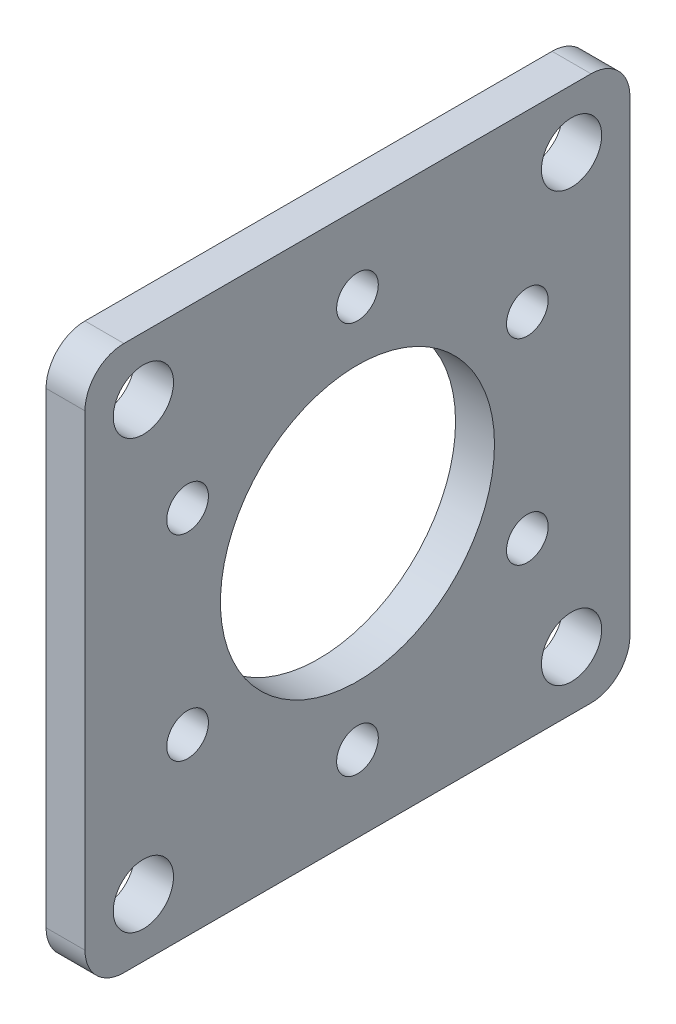
ISO-10303-21;
HEADER;
FILE_DESCRIPTION(('STEP AP214'),'2;1');
FILE_NAME('part.step','',(''),(''),'','','');
FILE_SCHEMA(('AUTOMOTIVE_DESIGN { 1 0 10303 214 1 1 1 1 }'));
ENDSEC;
DATA;
#1=APPLICATION_CONTEXT('core data for automotive mechanical design processes');
#2=APPLICATION_PROTOCOL_DEFINITION('international standard','automotive_design',2000,#1);
#3=PRODUCT_CONTEXT('',#1,'mechanical');
#4=PRODUCT('Part','Part','',(#3));
#5=PRODUCT_RELATED_PRODUCT_CATEGORY('part','',(#4));
#6=PRODUCT_DEFINITION_FORMATION('','',#4);
#7=PRODUCT_DEFINITION_CONTEXT('part definition',#1,'design');
#8=PRODUCT_DEFINITION('design','',#6,#7);
#9=PRODUCT_DEFINITION_SHAPE('','',#8);
#10=(LENGTH_UNIT() NAMED_UNIT(*) SI_UNIT(.MILLI.,.METRE.));
#11=(NAMED_UNIT(*) PLANE_ANGLE_UNIT() SI_UNIT($,.RADIAN.));
#12=(NAMED_UNIT(*) SI_UNIT($,.STERADIAN.) SOLID_ANGLE_UNIT());
#13=UNCERTAINTY_MEASURE_WITH_UNIT(LENGTH_MEASURE(1.E-05),#10,'distance_accuracy_value','');
#14=(GEOMETRIC_REPRESENTATION_CONTEXT(3) GLOBAL_UNCERTAINTY_ASSIGNED_CONTEXT((#13)) GLOBAL_UNIT_ASSIGNED_CONTEXT((#10,
#11,#12)) REPRESENTATION_CONTEXT('',''));
#15=CARTESIAN_POINT('',(0.,0.,0.));
#16=DIRECTION('',(0.,0.,1.));
#17=DIRECTION('',(1.,0.,0.));
#18=AXIS2_PLACEMENT_3D('',#15,#16,#17);
#19=CARTESIAN_POINT('',(3.175,0.,0.));
#20=DIRECTION('',(1.,0.,0.));
#21=DIRECTION('',(0.,0.,-1.));
#22=AXIS2_PLACEMENT_3D('',#19,#20,#21);
#23=PLANE('',#22);
#24=CARTESIAN_POINT('',(3.175,16.,0.));
#25=DIRECTION('',(1.,0.,0.));
#26=DIRECTION('',(0.,0.,-1.));
#27=AXIS2_PLACEMENT_3D('',#24,#25,#26);
#28=CIRCLE('',#27,1.7);
#29=CARTESIAN_POINT('',(3.175,16.,-1.7));
#30=VERTEX_POINT('',#29);
#31=EDGE_CURVE('E247',#30,#30,#28,.T.);
#32=ORIENTED_EDGE('',*,*,#31,.F.);
#33=EDGE_LOOP('',(#32));
#34=FACE_BOUND('',#33,.T.);
#35=CARTESIAN_POINT('',(3.175,8.00000000000145,-13.8564064605519));
#36=DIRECTION('',(1.,0.,0.));
#37=DIRECTION('',(0.,0.,-1.));
#38=AXIS2_PLACEMENT_3D('',#35,#36,#37);
#39=CIRCLE('',#38,1.7);
#40=CARTESIAN_POINT('',(3.175,8.00000000000145,-15.5564064605519));
#41=VERTEX_POINT('',#40);
#42=EDGE_CURVE('E241',#41,#41,#39,.T.);
#43=ORIENTED_EDGE('',*,*,#42,.F.);
#44=EDGE_LOOP('',(#43));
#45=FACE_BOUND('',#44,.T.);
#46=CARTESIAN_POINT('',(3.175,-7.99999999999855,-13.8564064605535));
#47=DIRECTION('',(1.,0.,0.));
#48=DIRECTION('',(0.,0.,-1.));
#49=AXIS2_PLACEMENT_3D('',#46,#47,#48);
#50=CIRCLE('',#49,1.7);
#51=CARTESIAN_POINT('',(3.175,-7.99999999999855,-15.5564064605535));
#52=VERTEX_POINT('',#51);
#53=EDGE_CURVE('E235',#52,#52,#50,.T.);
#54=ORIENTED_EDGE('',*,*,#53,.F.);
#55=EDGE_LOOP('',(#54));
#56=FACE_BOUND('',#55,.T.);
#57=CARTESIAN_POINT('',(3.175,-16.,-3.34338137020771E-12));
#58=DIRECTION('',(1.,0.,0.));
#59=DIRECTION('',(0.,0.,-1.));
#60=AXIS2_PLACEMENT_3D('',#57,#58,#59);
#61=CIRCLE('',#60,1.7);
#62=CARTESIAN_POINT('',(3.175,-16.,-1.70000000000334));
#63=VERTEX_POINT('',#62);
#64=EDGE_CURVE('E229',#63,#63,#61,.T.);
#65=ORIENTED_EDGE('',*,*,#64,.F.);
#66=EDGE_LOOP('',(#65));
#67=FACE_BOUND('',#66,.T.);
#68=CARTESIAN_POINT('',(3.175,-8.00000000000145,13.8564064605485));
#69=DIRECTION('',(1.,0.,0.));
#70=DIRECTION('',(0.,0.,-1.));
#71=AXIS2_PLACEMENT_3D('',#68,#69,#70);
#72=CIRCLE('',#71,1.7);
#73=CARTESIAN_POINT('',(3.175,-8.00000000000145,12.1564064605485));
#74=VERTEX_POINT('',#73);
#75=EDGE_CURVE('E223',#74,#74,#72,.T.);
#76=ORIENTED_EDGE('',*,*,#75,.F.);
#77=EDGE_LOOP('',(#76));
#78=FACE_BOUND('',#77,.T.);
#79=CARTESIAN_POINT('',(3.175,7.99999999999856,13.8564064605502));
#80=DIRECTION('',(1.,0.,0.));
#81=DIRECTION('',(0.,0.,-1.));
#82=AXIS2_PLACEMENT_3D('',#79,#80,#81);
#83=CIRCLE('',#82,1.7);
#84=CARTESIAN_POINT('',(3.175,7.99999999999856,12.1564064605502));
#85=VERTEX_POINT('',#84);
#86=EDGE_CURVE('E217',#85,#85,#83,.T.);
#87=ORIENTED_EDGE('',*,*,#86,.F.);
#88=EDGE_LOOP('',(#87));
#89=FACE_BOUND('',#88,.T.);
#90=CARTESIAN_POINT('',(3.175,17.4625,17.4625));
#91=DIRECTION('',(1.,0.,0.));
#92=DIRECTION('',(0.,0.,-1.));
#93=AXIS2_PLACEMENT_3D('',#90,#91,#92);
#94=CIRCLE('',#93,2.45745);
#95=CARTESIAN_POINT('',(3.175,17.4625,15.00505));
#96=VERTEX_POINT('',#95);
#97=EDGE_CURVE('E211',#96,#96,#94,.T.);
#98=ORIENTED_EDGE('',*,*,#97,.F.);
#99=EDGE_LOOP('',(#98));
#100=FACE_BOUND('',#99,.T.);
#101=CARTESIAN_POINT('',(3.175,17.4625,-17.4625));
#102=DIRECTION('',(1.,0.,0.));
#103=DIRECTION('',(0.,0.,-1.));
#104=AXIS2_PLACEMENT_3D('',#101,#102,#103);
#105=CIRCLE('',#104,2.45745);
#106=CARTESIAN_POINT('',(3.175,17.4625,-19.91995));
#107=VERTEX_POINT('',#106);
#108=EDGE_CURVE('E205',#107,#107,#105,.T.);
#109=ORIENTED_EDGE('',*,*,#108,.F.);
#110=EDGE_LOOP('',(#109));
#111=FACE_BOUND('',#110,.T.);
#112=CARTESIAN_POINT('',(3.175,-17.4625,-17.4625));
#113=DIRECTION('',(1.,0.,0.));
#114=DIRECTION('',(0.,0.,-1.));
#115=AXIS2_PLACEMENT_3D('',#112,#113,#114);
#116=CIRCLE('',#115,2.45745);
#117=CARTESIAN_POINT('',(3.175,-17.4625,-19.91995));
#118=VERTEX_POINT('',#117);
#119=EDGE_CURVE('E199',#118,#118,#116,.T.);
#120=ORIENTED_EDGE('',*,*,#119,.F.);
#121=EDGE_LOOP('',(#120));
#122=FACE_BOUND('',#121,.T.);
#123=CARTESIAN_POINT('',(3.175,-17.4625,17.4625));
#124=DIRECTION('',(1.,0.,0.));
#125=DIRECTION('',(0.,0.,-1.));
#126=AXIS2_PLACEMENT_3D('',#123,#124,#125);
#127=CIRCLE('',#126,2.45745);
#128=CARTESIAN_POINT('',(3.175,-17.4625,15.00505));
#129=VERTEX_POINT('',#128);
#130=EDGE_CURVE('E193',#129,#129,#127,.T.);
#131=ORIENTED_EDGE('',*,*,#130,.F.);
#132=EDGE_LOOP('',(#131));
#133=FACE_BOUND('',#132,.T.);
#134=DIRECTION('',(0.,0.,1.));
#135=VECTOR('',#134,1.);
#136=CARTESIAN_POINT('',(3.175,22.225,-22.225));
#137=LINE('',#136,#135);
#138=CARTESIAN_POINT('',(3.175,22.225,-19.05));
#139=VERTEX_POINT('',#138);
#140=CARTESIAN_POINT('',(3.175,22.225,19.05));
#141=VERTEX_POINT('',#140);
#142=EDGE_CURVE('E144',#139,#141,#137,.T.);
#143=ORIENTED_EDGE('',*,*,#142,.T.);
#144=CARTESIAN_POINT('',(3.175,19.05,19.05));
#145=DIRECTION('',(1.,0.,0.));
#146=DIRECTION('',(0.,0.,-1.));
#147=AXIS2_PLACEMENT_3D('',#144,#145,#146);
#148=CIRCLE('',#147,3.175);
#149=CARTESIAN_POINT('',(3.175,19.05,22.225));
#150=VERTEX_POINT('',#149);
#151=EDGE_CURVE('E163',#141,#150,#148,.T.);
#152=ORIENTED_EDGE('',*,*,#151,.T.);
#153=DIRECTION('',(0.,-1.,0.));
#154=VECTOR('',#153,1.);
#155=CARTESIAN_POINT('',(3.175,-22.225,22.225));
#156=LINE('',#155,#154);
#157=CARTESIAN_POINT('',(3.175,-19.05,22.225));
#158=VERTEX_POINT('',#157);
#159=EDGE_CURVE('E127',#150,#158,#156,.T.);
#160=ORIENTED_EDGE('',*,*,#159,.T.);
#161=CARTESIAN_POINT('',(3.175,-19.05,19.05));
#162=DIRECTION('',(1.,0.,0.));
#163=DIRECTION('',(0.,0.,-1.));
#164=AXIS2_PLACEMENT_3D('',#161,#162,#163);
#165=CIRCLE('',#164,3.175);
#166=CARTESIAN_POINT('',(3.175,-22.225,19.05));
#167=VERTEX_POINT('',#166);
#168=EDGE_CURVE('E158',#158,#167,#165,.T.);
#169=ORIENTED_EDGE('',*,*,#168,.T.);
#170=DIRECTION('',(0.,0.,-1.));
#171=VECTOR('',#170,1.);
#172=CARTESIAN_POINT('',(3.175,-22.225,-22.225));
#173=LINE('',#172,#171);
#174=CARTESIAN_POINT('',(3.175,-22.225,-19.05));
#175=VERTEX_POINT('',#174);
#176=EDGE_CURVE('E174',#167,#175,#173,.T.);
#177=ORIENTED_EDGE('',*,*,#176,.T.);
#178=CARTESIAN_POINT('',(3.175,-19.05,-19.05));
#179=DIRECTION('',(1.,0.,0.));
#180=DIRECTION('',(0.,0.,-1.));
#181=AXIS2_PLACEMENT_3D('',#178,#179,#180);
#182=CIRCLE('',#181,3.175);
#183=CARTESIAN_POINT('',(3.175,-19.05,-22.225));
#184=VERTEX_POINT('',#183);
#185=EDGE_CURVE('E63',#175,#184,#182,.T.);
#186=ORIENTED_EDGE('',*,*,#185,.T.);
#187=DIRECTION('',(0.,1.,0.));
#188=VECTOR('',#187,1.);
#189=CARTESIAN_POINT('',(3.175,-22.225,-22.225));
#190=LINE('',#189,#188);
#191=CARTESIAN_POINT('',(3.175,19.05,-22.225));
#192=VERTEX_POINT('',#191);
#193=EDGE_CURVE('E182',#184,#192,#190,.T.);
#194=ORIENTED_EDGE('',*,*,#193,.T.);
#195=CARTESIAN_POINT('',(3.175,19.05,-19.05));
#196=DIRECTION('',(1.,0.,0.));
#197=DIRECTION('',(0.,0.,-1.));
#198=AXIS2_PLACEMENT_3D('',#195,#196,#197);
#199=CIRCLE('',#198,3.175);
#200=EDGE_CURVE('E161',#192,#139,#199,.T.);
#201=ORIENTED_EDGE('',*,*,#200,.T.);
#202=EDGE_LOOP('',(#143,#152,#160,#169,#177,#186,#194,#201));
#203=FACE_BOUND('',#202,.T.);
#204=CARTESIAN_POINT('',(3.175,0.,0.));
#205=DIRECTION('',(1.,0.,0.));
#206=DIRECTION('',(0.,0.,-1.));
#207=AXIS2_PLACEMENT_3D('',#204,#205,#206);
#208=CIRCLE('',#207,11.176);
#209=CARTESIAN_POINT('',(3.175,0.,-11.176));
#210=VERTEX_POINT('',#209);
#211=EDGE_CURVE('E135',#210,#210,#208,.T.);
#212=ORIENTED_EDGE('',*,*,#211,.F.);
#213=EDGE_LOOP('',(#212));
#214=FACE_BOUND('',#213,.T.);
#215=ADVANCED_FACE('F41',(#34,#45,#56,#67,#78,#89,#100,#111,#122,#133,#203,#214),#23,.T.);
#216=CARTESIAN_POINT('',(0.,0.,0.));
#217=DIRECTION('',(1.,0.,0.));
#218=DIRECTION('',(0.,0.,-1.));
#219=AXIS2_PLACEMENT_3D('',#216,#217,#218);
#220=PLANE('',#219);
#221=CARTESIAN_POINT('',(0.,16.,0.));
#222=DIRECTION('',(1.,0.,0.));
#223=DIRECTION('',(0.,0.,-1.));
#224=AXIS2_PLACEMENT_3D('',#221,#222,#223);
#225=CIRCLE('',#224,1.7);
#226=CARTESIAN_POINT('',(0.,16.,-1.7));
#227=VERTEX_POINT('',#226);
#228=EDGE_CURVE('E244',#227,#227,#225,.T.);
#229=ORIENTED_EDGE('',*,*,#228,.T.);
#230=EDGE_LOOP('',(#229));
#231=FACE_BOUND('',#230,.T.);
#232=CARTESIAN_POINT('',(0.,8.00000000000145,-13.8564064605519));
#233=DIRECTION('',(1.,0.,0.));
#234=DIRECTION('',(0.,0.,-1.));
#235=AXIS2_PLACEMENT_3D('',#232,#233,#234);
#236=CIRCLE('',#235,1.7);
#237=CARTESIAN_POINT('',(0.,8.00000000000145,-15.5564064605519));
#238=VERTEX_POINT('',#237);
#239=EDGE_CURVE('E238',#238,#238,#236,.T.);
#240=ORIENTED_EDGE('',*,*,#239,.T.);
#241=EDGE_LOOP('',(#240));
#242=FACE_BOUND('',#241,.T.);
#243=CARTESIAN_POINT('',(0.,-7.99999999999855,-13.8564064605535));
#244=DIRECTION('',(1.,0.,0.));
#245=DIRECTION('',(0.,0.,-1.));
#246=AXIS2_PLACEMENT_3D('',#243,#244,#245);
#247=CIRCLE('',#246,1.7);
#248=CARTESIAN_POINT('',(0.,-7.99999999999855,-15.5564064605535));
#249=VERTEX_POINT('',#248);
#250=EDGE_CURVE('E232',#249,#249,#247,.T.);
#251=ORIENTED_EDGE('',*,*,#250,.T.);
#252=EDGE_LOOP('',(#251));
#253=FACE_BOUND('',#252,.T.);
#254=CARTESIAN_POINT('',(0.,-16.,-3.34338137020771E-12));
#255=DIRECTION('',(1.,0.,0.));
#256=DIRECTION('',(0.,0.,-1.));
#257=AXIS2_PLACEMENT_3D('',#254,#255,#256);
#258=CIRCLE('',#257,1.7);
#259=CARTESIAN_POINT('',(0.,-16.,-1.70000000000334));
#260=VERTEX_POINT('',#259);
#261=EDGE_CURVE('E226',#260,#260,#258,.T.);
#262=ORIENTED_EDGE('',*,*,#261,.T.);
#263=EDGE_LOOP('',(#262));
#264=FACE_BOUND('',#263,.T.);
#265=CARTESIAN_POINT('',(0.,-8.00000000000145,13.8564064605485));
#266=DIRECTION('',(1.,0.,0.));
#267=DIRECTION('',(0.,0.,-1.));
#268=AXIS2_PLACEMENT_3D('',#265,#266,#267);
#269=CIRCLE('',#268,1.7);
#270=CARTESIAN_POINT('',(0.,-8.00000000000145,12.1564064605485));
#271=VERTEX_POINT('',#270);
#272=EDGE_CURVE('E220',#271,#271,#269,.T.);
#273=ORIENTED_EDGE('',*,*,#272,.T.);
#274=EDGE_LOOP('',(#273));
#275=FACE_BOUND('',#274,.T.);
#276=CARTESIAN_POINT('',(0.,7.99999999999856,13.8564064605502));
#277=DIRECTION('',(1.,0.,0.));
#278=DIRECTION('',(0.,0.,-1.));
#279=AXIS2_PLACEMENT_3D('',#276,#277,#278);
#280=CIRCLE('',#279,1.7);
#281=CARTESIAN_POINT('',(0.,7.99999999999856,12.1564064605502));
#282=VERTEX_POINT('',#281);
#283=EDGE_CURVE('E214',#282,#282,#280,.T.);
#284=ORIENTED_EDGE('',*,*,#283,.T.);
#285=EDGE_LOOP('',(#284));
#286=FACE_BOUND('',#285,.T.);
#287=CARTESIAN_POINT('',(0.,17.4625,17.4625));
#288=DIRECTION('',(1.,0.,0.));
#289=DIRECTION('',(0.,0.,-1.));
#290=AXIS2_PLACEMENT_3D('',#287,#288,#289);
#291=CIRCLE('',#290,2.45745);
#292=CARTESIAN_POINT('',(0.,17.4625,15.00505));
#293=VERTEX_POINT('',#292);
#294=EDGE_CURVE('E208',#293,#293,#291,.T.);
#295=ORIENTED_EDGE('',*,*,#294,.T.);
#296=EDGE_LOOP('',(#295));
#297=FACE_BOUND('',#296,.T.);
#298=CARTESIAN_POINT('',(0.,17.4625,-17.4625));
#299=DIRECTION('',(1.,0.,0.));
#300=DIRECTION('',(0.,0.,-1.));
#301=AXIS2_PLACEMENT_3D('',#298,#299,#300);
#302=CIRCLE('',#301,2.45745);
#303=CARTESIAN_POINT('',(0.,17.4625,-19.91995));
#304=VERTEX_POINT('',#303);
#305=EDGE_CURVE('E202',#304,#304,#302,.T.);
#306=ORIENTED_EDGE('',*,*,#305,.T.);
#307=EDGE_LOOP('',(#306));
#308=FACE_BOUND('',#307,.T.);
#309=CARTESIAN_POINT('',(0.,-17.4625,-17.4625));
#310=DIRECTION('',(1.,0.,0.));
#311=DIRECTION('',(0.,0.,-1.));
#312=AXIS2_PLACEMENT_3D('',#309,#310,#311);
#313=CIRCLE('',#312,2.45745);
#314=CARTESIAN_POINT('',(0.,-17.4625,-19.91995));
#315=VERTEX_POINT('',#314);
#316=EDGE_CURVE('E196',#315,#315,#313,.T.);
#317=ORIENTED_EDGE('',*,*,#316,.T.);
#318=EDGE_LOOP('',(#317));
#319=FACE_BOUND('',#318,.T.);
#320=CARTESIAN_POINT('',(0.,-17.4625,17.4625));
#321=DIRECTION('',(1.,0.,0.));
#322=DIRECTION('',(0.,0.,-1.));
#323=AXIS2_PLACEMENT_3D('',#320,#321,#322);
#324=CIRCLE('',#323,2.45745);
#325=CARTESIAN_POINT('',(0.,-17.4625,15.00505));
#326=VERTEX_POINT('',#325);
#327=EDGE_CURVE('E189',#326,#326,#324,.T.);
#328=ORIENTED_EDGE('',*,*,#327,.T.);
#329=EDGE_LOOP('',(#328));
#330=FACE_BOUND('',#329,.T.);
#331=DIRECTION('',(0.,-1.,0.));
#332=VECTOR('',#331,1.);
#333=CARTESIAN_POINT('',(0.,-22.225,22.225));
#334=LINE('',#333,#332);
#335=CARTESIAN_POINT('',(0.,19.05,22.225));
#336=VERTEX_POINT('',#335);
#337=CARTESIAN_POINT('',(0.,-19.05,22.225));
#338=VERTEX_POINT('',#337);
#339=EDGE_CURVE('E124',#336,#338,#334,.T.);
#340=ORIENTED_EDGE('',*,*,#339,.F.);
#341=CARTESIAN_POINT('',(0.,19.05,19.05));
#342=DIRECTION('',(1.,0.,0.));
#343=DIRECTION('',(0.,0.,-1.));
#344=AXIS2_PLACEMENT_3D('',#341,#342,#343);
#345=CIRCLE('',#344,3.175);
#346=CARTESIAN_POINT('',(0.,22.225,19.05));
#347=VERTEX_POINT('',#346);
#348=EDGE_CURVE('E107',#336,#347,#345,.F.);
#349=ORIENTED_EDGE('',*,*,#348,.T.);
#350=DIRECTION('',(0.,0.,1.));
#351=VECTOR('',#350,1.);
#352=CARTESIAN_POINT('',(0.,22.225,-22.225));
#353=LINE('',#352,#351);
#354=CARTESIAN_POINT('',(0.,22.225,-19.05));
#355=VERTEX_POINT('',#354);
#356=EDGE_CURVE('E148',#355,#347,#353,.T.);
#357=ORIENTED_EDGE('',*,*,#356,.F.);
#358=CARTESIAN_POINT('',(0.,19.05,-19.05));
#359=DIRECTION('',(1.,0.,0.));
#360=DIRECTION('',(0.,0.,-1.));
#361=AXIS2_PLACEMENT_3D('',#358,#359,#360);
#362=CIRCLE('',#361,3.175);
#363=CARTESIAN_POINT('',(0.,19.05,-22.225));
#364=VERTEX_POINT('',#363);
#365=EDGE_CURVE('E118',#355,#364,#362,.F.);
#366=ORIENTED_EDGE('',*,*,#365,.T.);
#367=DIRECTION('',(0.,1.,0.));
#368=VECTOR('',#367,1.);
#369=CARTESIAN_POINT('',(0.,-22.225,-22.225));
#370=LINE('',#369,#368);
#371=CARTESIAN_POINT('',(0.,-19.05,-22.225));
#372=VERTEX_POINT('',#371);
#373=EDGE_CURVE('E138',#372,#364,#370,.T.);
#374=ORIENTED_EDGE('',*,*,#373,.F.);
#375=CARTESIAN_POINT('',(0.,-19.05,-19.05));
#376=DIRECTION('',(1.,0.,0.));
#377=DIRECTION('',(0.,0.,-1.));
#378=AXIS2_PLACEMENT_3D('',#375,#376,#377);
#379=CIRCLE('',#378,3.175);
#380=CARTESIAN_POINT('',(0.,-22.225,-19.05));
#381=VERTEX_POINT('',#380);
#382=EDGE_CURVE('E152',#372,#381,#379,.F.);
#383=ORIENTED_EDGE('',*,*,#382,.T.);
#384=DIRECTION('',(0.,0.,-1.));
#385=VECTOR('',#384,1.);
#386=CARTESIAN_POINT('',(0.,-22.225,-22.225));
#387=LINE('',#386,#385);
#388=CARTESIAN_POINT('',(0.,-22.225,19.05));
#389=VERTEX_POINT('',#388);
#390=EDGE_CURVE('E134',#389,#381,#387,.T.);
#391=ORIENTED_EDGE('',*,*,#390,.F.);
#392=CARTESIAN_POINT('',(0.,-19.05,19.05));
#393=DIRECTION('',(1.,0.,0.));
#394=DIRECTION('',(0.,0.,-1.));
#395=AXIS2_PLACEMENT_3D('',#392,#393,#394);
#396=CIRCLE('',#395,3.175);
#397=EDGE_CURVE('E128',#389,#338,#396,.F.);
#398=ORIENTED_EDGE('',*,*,#397,.T.);
#399=EDGE_LOOP('',(#340,#349,#357,#366,#374,#383,#391,#398));
#400=FACE_BOUND('',#399,.T.);
#401=CARTESIAN_POINT('',(0.,0.,0.));
#402=DIRECTION('',(1.,0.,0.));
#403=DIRECTION('',(0.,0.,-1.));
#404=AXIS2_PLACEMENT_3D('',#401,#402,#403);
#405=CIRCLE('',#404,11.176);
#406=CARTESIAN_POINT('',(0.,0.,-11.176));
#407=VERTEX_POINT('',#406);
#408=EDGE_CURVE('E141',#407,#407,#405,.T.);
#409=ORIENTED_EDGE('',*,*,#408,.T.);
#410=EDGE_LOOP('',(#409));
#411=FACE_BOUND('',#410,.T.);
#412=ADVANCED_FACE('F131',(#231,#242,#253,#264,#275,#286,#297,#308,#319,#330,#400,#411),#220,.F.);
#413=CARTESIAN_POINT('',(3.175,-22.225,22.225));
#414=DIRECTION('',(0.,0.,-1.));
#415=DIRECTION('',(-1.,0.,0.));
#416=AXIS2_PLACEMENT_3D('',#413,#414,#415);
#417=PLANE('',#416);
#418=ORIENTED_EDGE('',*,*,#159,.F.);
#419=DIRECTION('',(-1.,0.,0.));
#420=VECTOR('',#419,1.);
#421=CARTESIAN_POINT('',(3.175,19.05,22.225));
#422=LINE('',#421,#420);
#423=EDGE_CURVE('E111',#150,#336,#422,.T.);
#424=ORIENTED_EDGE('',*,*,#423,.T.);
#425=ORIENTED_EDGE('',*,*,#339,.T.);
#426=DIRECTION('',(-1.,0.,0.));
#427=VECTOR('',#426,1.);
#428=CARTESIAN_POINT('',(3.175,-19.05,22.225));
#429=LINE('',#428,#427);
#430=EDGE_CURVE('E129',#338,#158,#429,.F.);
#431=ORIENTED_EDGE('',*,*,#430,.T.);
#432=EDGE_LOOP('',(#418,#424,#425,#431));
#433=FACE_BOUND('',#432,.T.);
#434=ADVANCED_FACE('F123',(#433),#417,.F.);
#435=CARTESIAN_POINT('',(3.175,-22.225,-22.225));
#436=DIRECTION('',(0.,1.,0.));
#437=DIRECTION('',(0.,0.,1.));
#438=AXIS2_PLACEMENT_3D('',#435,#436,#437);
#439=PLANE('',#438);
#440=ORIENTED_EDGE('',*,*,#390,.T.);
#441=DIRECTION('',(-1.,0.,0.));
#442=VECTOR('',#441,1.);
#443=CARTESIAN_POINT('',(3.175,-22.225,-19.05));
#444=LINE('',#443,#442);
#445=EDGE_CURVE('E11',#381,#175,#444,.F.);
#446=ORIENTED_EDGE('',*,*,#445,.T.);
#447=ORIENTED_EDGE('',*,*,#176,.F.);
#448=DIRECTION('',(-1.,0.,0.));
#449=VECTOR('',#448,1.);
#450=CARTESIAN_POINT('',(3.175,-22.225,19.05));
#451=LINE('',#450,#449);
#452=EDGE_CURVE('E49',#167,#389,#451,.T.);
#453=ORIENTED_EDGE('',*,*,#452,.T.);
#454=EDGE_LOOP('',(#440,#446,#447,#453));
#455=FACE_BOUND('',#454,.T.);
#456=ADVANCED_FACE('F172',(#455),#439,.F.);
#457=CARTESIAN_POINT('',(3.175,-22.225,-22.225));
#458=DIRECTION('',(0.,0.,1.));
#459=DIRECTION('',(1.,0.,0.));
#460=AXIS2_PLACEMENT_3D('',#457,#458,#459);
#461=PLANE('',#460);
#462=ORIENTED_EDGE('',*,*,#373,.T.);
#463=DIRECTION('',(-1.,0.,0.));
#464=VECTOR('',#463,1.);
#465=CARTESIAN_POINT('',(3.175,19.05,-22.225));
#466=LINE('',#465,#464);
#467=EDGE_CURVE('E56',#364,#192,#466,.F.);
#468=ORIENTED_EDGE('',*,*,#467,.T.);
#469=ORIENTED_EDGE('',*,*,#193,.F.);
#470=DIRECTION('',(-1.,0.,0.));
#471=VECTOR('',#470,1.);
#472=CARTESIAN_POINT('',(3.175,-19.05,-22.225));
#473=LINE('',#472,#471);
#474=EDGE_CURVE('E165',#184,#372,#473,.T.);
#475=ORIENTED_EDGE('',*,*,#474,.T.);
#476=EDGE_LOOP('',(#462,#468,#469,#475));
#477=FACE_BOUND('',#476,.T.);
#478=ADVANCED_FACE('F181',(#477),#461,.F.);
#479=CARTESIAN_POINT('',(3.175,22.225,-22.225));
#480=DIRECTION('',(0.,-1.,0.));
#481=DIRECTION('',(0.,0.,-1.));
#482=AXIS2_PLACEMENT_3D('',#479,#480,#481);
#483=PLANE('',#482);
#484=ORIENTED_EDGE('',*,*,#356,.T.);
#485=DIRECTION('',(-1.,0.,0.));
#486=VECTOR('',#485,1.);
#487=CARTESIAN_POINT('',(3.175,22.225,19.05));
#488=LINE('',#487,#486);
#489=EDGE_CURVE('E112',#347,#141,#488,.F.);
#490=ORIENTED_EDGE('',*,*,#489,.T.);
#491=ORIENTED_EDGE('',*,*,#142,.F.);
#492=DIRECTION('',(-1.,0.,0.));
#493=VECTOR('',#492,1.);
#494=CARTESIAN_POINT('',(3.175,22.225,-19.05));
#495=LINE('',#494,#493);
#496=EDGE_CURVE('E117',#139,#355,#495,.T.);
#497=ORIENTED_EDGE('',*,*,#496,.T.);
#498=EDGE_LOOP('',(#484,#490,#491,#497));
#499=FACE_BOUND('',#498,.T.);
#500=ADVANCED_FACE('F281',(#499),#483,.F.);
#501=CARTESIAN_POINT('',(3.175,0.,0.));
#502=DIRECTION('',(-1.,0.,0.));
#503=DIRECTION('',(0.,0.,1.));
#504=AXIS2_PLACEMENT_3D('',#501,#502,#503);
#505=CYLINDRICAL_SURFACE('',#504,11.176);
#506=ORIENTED_EDGE('',*,*,#211,.T.);
#507=EDGE_LOOP('',(#506));
#508=FACE_BOUND('',#507,.T.);
#509=ORIENTED_EDGE('',*,*,#408,.F.);
#510=EDGE_LOOP('',(#509));
#511=FACE_BOUND('',#510,.T.);
#512=ADVANCED_FACE('F277',(#508,#511),#505,.F.);
#513=CARTESIAN_POINT('',(3.175,-17.4625,17.4625));
#514=DIRECTION('',(1.,0.,0.));
#515=DIRECTION('',(0.,0.,-1.));
#516=AXIS2_PLACEMENT_3D('',#513,#514,#515);
#517=CYLINDRICAL_SURFACE('',#516,2.45745);
#518=ORIENTED_EDGE('',*,*,#327,.F.);
#519=EDGE_LOOP('',(#518));
#520=FACE_BOUND('',#519,.T.);
#521=ORIENTED_EDGE('',*,*,#130,.T.);
#522=EDGE_LOOP('',(#521));
#523=FACE_BOUND('',#522,.T.);
#524=ADVANCED_FACE('F280',(#520,#523),#517,.F.);
#525=CARTESIAN_POINT('',(3.175,-17.4625,-17.4625));
#526=DIRECTION('',(1.,0.,0.));
#527=DIRECTION('',(0.,0.,-1.));
#528=AXIS2_PLACEMENT_3D('',#525,#526,#527);
#529=CYLINDRICAL_SURFACE('',#528,2.45745);
#530=ORIENTED_EDGE('',*,*,#316,.F.);
#531=EDGE_LOOP('',(#530));
#532=FACE_BOUND('',#531,.T.);
#533=ORIENTED_EDGE('',*,*,#119,.T.);
#534=EDGE_LOOP('',(#533));
#535=FACE_BOUND('',#534,.T.);
#536=ADVANCED_FACE('F407',(#532,#535),#529,.F.);
#537=CARTESIAN_POINT('',(3.175,17.4625,-17.4625));
#538=DIRECTION('',(1.,0.,0.));
#539=DIRECTION('',(0.,0.,-1.));
#540=AXIS2_PLACEMENT_3D('',#537,#538,#539);
#541=CYLINDRICAL_SURFACE('',#540,2.45745);
#542=ORIENTED_EDGE('',*,*,#305,.F.);
#543=EDGE_LOOP('',(#542));
#544=FACE_BOUND('',#543,.T.);
#545=ORIENTED_EDGE('',*,*,#108,.T.);
#546=EDGE_LOOP('',(#545));
#547=FACE_BOUND('',#546,.T.);
#548=ADVANCED_FACE('F397',(#544,#547),#541,.F.);
#549=CARTESIAN_POINT('',(3.175,17.4625,17.4625));
#550=DIRECTION('',(1.,0.,0.));
#551=DIRECTION('',(0.,0.,-1.));
#552=AXIS2_PLACEMENT_3D('',#549,#550,#551);
#553=CYLINDRICAL_SURFACE('',#552,2.45745);
#554=ORIENTED_EDGE('',*,*,#294,.F.);
#555=EDGE_LOOP('',(#554));
#556=FACE_BOUND('',#555,.T.);
#557=ORIENTED_EDGE('',*,*,#97,.T.);
#558=EDGE_LOOP('',(#557));
#559=FACE_BOUND('',#558,.T.);
#560=ADVANCED_FACE('F387',(#556,#559),#553,.F.);
#561=CARTESIAN_POINT('',(3.175,7.99999999999856,13.8564064605502));
#562=DIRECTION('',(1.,0.,0.));
#563=DIRECTION('',(0.,0.,-1.));
#564=AXIS2_PLACEMENT_3D('',#561,#562,#563);
#565=CYLINDRICAL_SURFACE('',#564,1.7);
#566=ORIENTED_EDGE('',*,*,#283,.F.);
#567=EDGE_LOOP('',(#566));
#568=FACE_BOUND('',#567,.T.);
#569=ORIENTED_EDGE('',*,*,#86,.T.);
#570=EDGE_LOOP('',(#569));
#571=FACE_BOUND('',#570,.T.);
#572=ADVANCED_FACE('F377',(#568,#571),#565,.F.);
#573=CARTESIAN_POINT('',(3.175,-8.00000000000145,13.8564064605485));
#574=DIRECTION('',(1.,0.,0.));
#575=DIRECTION('',(0.,0.,-1.));
#576=AXIS2_PLACEMENT_3D('',#573,#574,#575);
#577=CYLINDRICAL_SURFACE('',#576,1.7);
#578=ORIENTED_EDGE('',*,*,#272,.F.);
#579=EDGE_LOOP('',(#578));
#580=FACE_BOUND('',#579,.T.);
#581=ORIENTED_EDGE('',*,*,#75,.T.);
#582=EDGE_LOOP('',(#581));
#583=FACE_BOUND('',#582,.T.);
#584=ADVANCED_FACE('F367',(#580,#583),#577,.F.);
#585=CARTESIAN_POINT('',(3.175,-16.,-3.34338137020771E-12));
#586=DIRECTION('',(1.,0.,0.));
#587=DIRECTION('',(0.,0.,-1.));
#588=AXIS2_PLACEMENT_3D('',#585,#586,#587);
#589=CYLINDRICAL_SURFACE('',#588,1.7);
#590=ORIENTED_EDGE('',*,*,#261,.F.);
#591=EDGE_LOOP('',(#590));
#592=FACE_BOUND('',#591,.T.);
#593=ORIENTED_EDGE('',*,*,#64,.T.);
#594=EDGE_LOOP('',(#593));
#595=FACE_BOUND('',#594,.T.);
#596=ADVANCED_FACE('F357',(#592,#595),#589,.F.);
#597=CARTESIAN_POINT('',(3.175,-7.99999999999855,-13.8564064605535));
#598=DIRECTION('',(1.,0.,0.));
#599=DIRECTION('',(0.,0.,-1.));
#600=AXIS2_PLACEMENT_3D('',#597,#598,#599);
#601=CYLINDRICAL_SURFACE('',#600,1.7);
#602=ORIENTED_EDGE('',*,*,#250,.F.);
#603=EDGE_LOOP('',(#602));
#604=FACE_BOUND('',#603,.T.);
#605=ORIENTED_EDGE('',*,*,#53,.T.);
#606=EDGE_LOOP('',(#605));
#607=FACE_BOUND('',#606,.T.);
#608=ADVANCED_FACE('F347',(#604,#607),#601,.F.);
#609=CARTESIAN_POINT('',(3.175,8.00000000000145,-13.8564064605519));
#610=DIRECTION('',(1.,0.,0.));
#611=DIRECTION('',(0.,0.,-1.));
#612=AXIS2_PLACEMENT_3D('',#609,#610,#611);
#613=CYLINDRICAL_SURFACE('',#612,1.7);
#614=ORIENTED_EDGE('',*,*,#239,.F.);
#615=EDGE_LOOP('',(#614));
#616=FACE_BOUND('',#615,.T.);
#617=ORIENTED_EDGE('',*,*,#42,.T.);
#618=EDGE_LOOP('',(#617));
#619=FACE_BOUND('',#618,.T.);
#620=ADVANCED_FACE('F337',(#616,#619),#613,.F.);
#621=CARTESIAN_POINT('',(3.175,16.,0.));
#622=DIRECTION('',(1.,0.,0.));
#623=DIRECTION('',(0.,0.,-1.));
#624=AXIS2_PLACEMENT_3D('',#621,#622,#623);
#625=CYLINDRICAL_SURFACE('',#624,1.7);
#626=ORIENTED_EDGE('',*,*,#228,.F.);
#627=EDGE_LOOP('',(#626));
#628=FACE_BOUND('',#627,.T.);
#629=ORIENTED_EDGE('',*,*,#31,.T.);
#630=EDGE_LOOP('',(#629));
#631=FACE_BOUND('',#630,.T.);
#632=ADVANCED_FACE('F251',(#628,#631),#625,.F.);
#633=CARTESIAN_POINT('',(3.175,19.05,19.05));
#634=DIRECTION('',(-1.,0.,0.));
#635=DIRECTION('',(0.,0.,1.));
#636=AXIS2_PLACEMENT_3D('',#633,#634,#635);
#637=CYLINDRICAL_SURFACE('',#636,3.175);
#638=ORIENTED_EDGE('',*,*,#151,.F.);
#639=ORIENTED_EDGE('',*,*,#489,.F.);
#640=ORIENTED_EDGE('',*,*,#348,.F.);
#641=ORIENTED_EDGE('',*,*,#423,.F.);
#642=EDGE_LOOP('',(#638,#639,#640,#641));
#643=FACE_BOUND('',#642,.T.);
#644=ADVANCED_FACE('F110',(#643),#637,.T.);
#645=CARTESIAN_POINT('',(3.175,19.05,-19.05));
#646=DIRECTION('',(-1.,0.,0.));
#647=DIRECTION('',(0.,0.,1.));
#648=AXIS2_PLACEMENT_3D('',#645,#646,#647);
#649=CYLINDRICAL_SURFACE('',#648,3.175);
#650=ORIENTED_EDGE('',*,*,#200,.F.);
#651=ORIENTED_EDGE('',*,*,#467,.F.);
#652=ORIENTED_EDGE('',*,*,#365,.F.);
#653=ORIENTED_EDGE('',*,*,#496,.F.);
#654=EDGE_LOOP('',(#650,#651,#652,#653));
#655=FACE_BOUND('',#654,.T.);
#656=ADVANCED_FACE('F302',(#655),#649,.T.);
#657=CARTESIAN_POINT('',(3.175,-19.05,-19.05));
#658=DIRECTION('',(-1.,0.,0.));
#659=DIRECTION('',(0.,0.,1.));
#660=AXIS2_PLACEMENT_3D('',#657,#658,#659);
#661=CYLINDRICAL_SURFACE('',#660,3.175);
#662=ORIENTED_EDGE('',*,*,#185,.F.);
#663=ORIENTED_EDGE('',*,*,#445,.F.);
#664=ORIENTED_EDGE('',*,*,#382,.F.);
#665=ORIENTED_EDGE('',*,*,#474,.F.);
#666=EDGE_LOOP('',(#662,#663,#664,#665));
#667=FACE_BOUND('',#666,.T.);
#668=ADVANCED_FACE('F180',(#667),#661,.T.);
#669=CARTESIAN_POINT('',(3.175,-19.05,19.05));
#670=DIRECTION('',(-1.,0.,0.));
#671=DIRECTION('',(0.,0.,1.));
#672=AXIS2_PLACEMENT_3D('',#669,#670,#671);
#673=CYLINDRICAL_SURFACE('',#672,3.175);
#674=ORIENTED_EDGE('',*,*,#168,.F.);
#675=ORIENTED_EDGE('',*,*,#430,.F.);
#676=ORIENTED_EDGE('',*,*,#397,.F.);
#677=ORIENTED_EDGE('',*,*,#452,.F.);
#678=EDGE_LOOP('',(#674,#675,#676,#677));
#679=FACE_BOUND('',#678,.T.);
#680=ADVANCED_FACE('F43',(#679),#673,.T.);
#681=CLOSED_SHELL('',(#215,#412,#434,#456,#478,#500,#512,#524,#536,#548,#560,#572,#584,#596,
#608,#620,#632,#644,#656,#668,#680));
#682=MANIFOLD_SOLID_BREP('B2',#681);
#683=ADVANCED_BREP_SHAPE_REPRESENTATION('',(#18,#682),#14);
#684=SHAPE_DEFINITION_REPRESENTATION(#9,#683);
ENDSEC;
END-ISO-10303-21;
